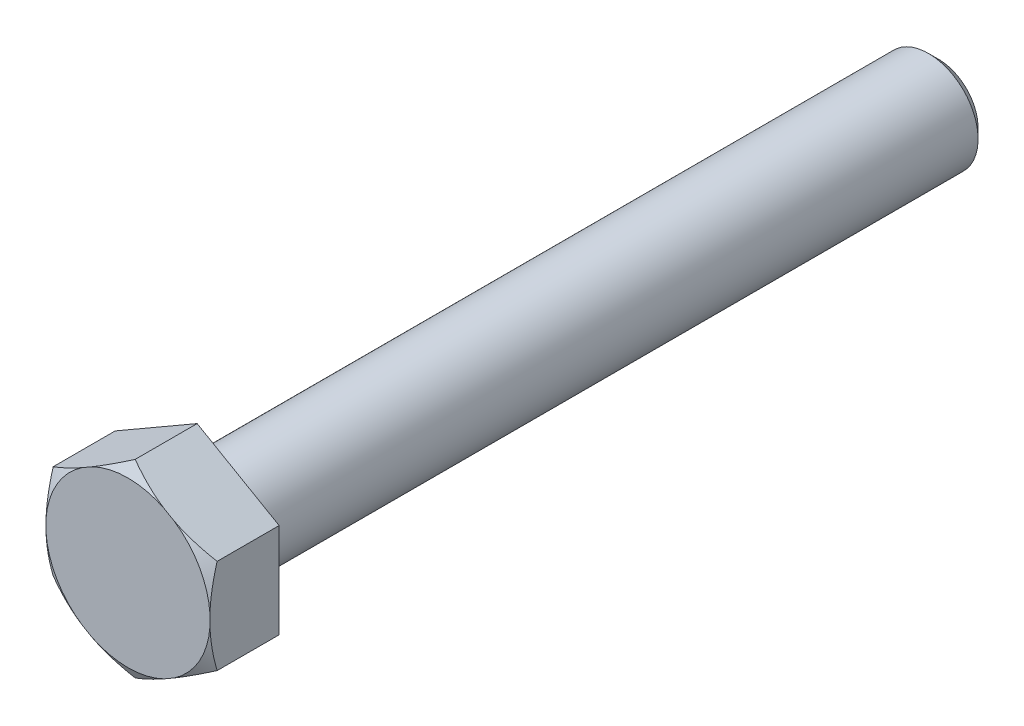
ISO-10303-21;
HEADER;
FILE_DESCRIPTION(('STEP AP214'),'2;1');
FILE_NAME('part.step','',(''),(''),'','','');
FILE_SCHEMA(('AUTOMOTIVE_DESIGN { 1 0 10303 214 1 1 1 1 }'));
ENDSEC;
DATA;
#1=APPLICATION_CONTEXT('core data for automotive mechanical design processes');
#2=APPLICATION_PROTOCOL_DEFINITION('international standard','automotive_design',2000,#1);
#3=PRODUCT_CONTEXT('',#1,'mechanical');
#4=PRODUCT('Part','Part','',(#3));
#5=PRODUCT_RELATED_PRODUCT_CATEGORY('part','',(#4));
#6=PRODUCT_DEFINITION_FORMATION('','',#4);
#7=PRODUCT_DEFINITION_CONTEXT('part definition',#1,'design');
#8=PRODUCT_DEFINITION('design','',#6,#7);
#9=PRODUCT_DEFINITION_SHAPE('','',#8);
#10=(LENGTH_UNIT() NAMED_UNIT(*) SI_UNIT(.MILLI.,.METRE.));
#11=(NAMED_UNIT(*) PLANE_ANGLE_UNIT() SI_UNIT($,.RADIAN.));
#12=(NAMED_UNIT(*) SI_UNIT($,.STERADIAN.) SOLID_ANGLE_UNIT());
#13=UNCERTAINTY_MEASURE_WITH_UNIT(LENGTH_MEASURE(1.E-05),#10,'distance_accuracy_value','');
#14=(GEOMETRIC_REPRESENTATION_CONTEXT(3) GLOBAL_UNCERTAINTY_ASSIGNED_CONTEXT((#13)) GLOBAL_UNIT_ASSIGNED_CONTEXT((#10,
#11,#12)) REPRESENTATION_CONTEXT('',''));
#15=CARTESIAN_POINT('',(0.,0.,0.));
#16=DIRECTION('',(0.,0.,1.));
#17=DIRECTION('',(1.,0.,0.));
#18=AXIS2_PLACEMENT_3D('',#15,#16,#17);
#19=CARTESIAN_POINT('',(0.,0.,0.));
#20=DIRECTION('',(0.,0.,1.));
#21=DIRECTION('',(0.999999999999997,0.,0.));
#22=AXIS2_PLACEMENT_3D('',#19,#20,#21);
#23=PLANE('',#22);
#24=CARTESIAN_POINT('',(0.,0.,0.));
#25=DIRECTION('',(0.,0.,1.));
#26=DIRECTION('',(0.999999999999997,0.,0.));
#27=AXIS2_PLACEMENT_3D('',#24,#25,#26);
#28=CIRCLE('',#27,3.325);
#29=CARTESIAN_POINT('',(3.31687729649241,-0.232271392987038,0.));
#30=VERTEX_POINT('',#29);
#31=CARTESIAN_POINT('',(1.85959157514512,-2.75636430350722,-3.7470027081099E-13));
#32=VERTEX_POINT('',#31);
#33=EDGE_CURVE('E171',#30,#32,#28,.F.);
#34=ORIENTED_EDGE('',*,*,#33,.F.);
#35=DIRECTION('',(0.,0.999999999999989,0.));
#36=VECTOR('',#35,1.);
#37=CARTESIAN_POINT('',(3.31687729649335,-1.91500000000049,-3.92047505570758E-13));
#38=LINE('',#37,#36);
#39=CARTESIAN_POINT('',(3.31687729649247,0.232271392986212,0.));
#40=VERTEX_POINT('',#39);
#41=EDGE_CURVE('E297',#30,#40,#38,.T.);
#42=ORIENTED_EDGE('',*,*,#41,.T.);
#43=CARTESIAN_POINT('',(1.85959157514506,2.75636430350629,0.));
#44=VERTEX_POINT('',#43);
#45=EDGE_CURVE('E167',#44,#40,#28,.F.);
#46=ORIENTED_EDGE('',*,*,#45,.F.);
#47=DIRECTION('',(-0.86602540378443,0.499999999999995,0.));
#48=VECTOR('',#47,1.);
#49=CARTESIAN_POINT('',(3.31687729649346,1.91499999999944,0.));
#50=LINE('',#49,#48);
#51=CARTESIAN_POINT('',(1.45728572134776,2.98863569649339,0.));
#52=VERTEX_POINT('',#51);
#53=EDGE_CURVE('E306',#44,#52,#50,.T.);
#54=ORIENTED_EDGE('',*,*,#53,.T.);
#55=CARTESIAN_POINT('',(-1.45728572134907,2.9886356964936,0.));
#56=VERTEX_POINT('',#55);
#57=EDGE_CURVE('E169',#56,#52,#28,.F.);
#58=ORIENTED_EDGE('',*,*,#57,.F.);
#59=DIRECTION('',(-0.866025403784429,-0.499999999999997,0.));
#60=VECTOR('',#59,1.);
#61=CARTESIAN_POINT('',(-5.27355936696949E-13,3.83000000000001,0.));
#62=LINE('',#61,#60);
#63=CARTESIAN_POINT('',(-1.85959157514795,2.75636430350642,0.));
#64=VERTEX_POINT('',#63);
#65=EDGE_CURVE('E166',#56,#64,#62,.T.);
#66=ORIENTED_EDGE('',*,*,#65,.T.);
#67=CARTESIAN_POINT('',(0.,0.,0.));
#68=DIRECTION('',(0.,0.,-1.));
#69=DIRECTION('',(-0.999999999999997,0.,0.));
#70=AXIS2_PLACEMENT_3D('',#67,#68,#69);
#71=CIRCLE('',#70,3.325);
#72=CARTESIAN_POINT('',(-3.31687729649488,0.232271392986365,0.));
#73=VERTEX_POINT('',#72);
#74=EDGE_CURVE('E130',#73,#64,#71,.T.);
#75=ORIENTED_EDGE('',*,*,#74,.F.);
#76=DIRECTION('',(0.,-0.999999999999992,0.));
#77=VECTOR('',#76,1.);
#78=CARTESIAN_POINT('',(-3.31687729649571,1.91499999999966,0.));
#79=LINE('',#78,#77);
#80=CARTESIAN_POINT('',(-3.3168772964958,-0.23227139298726,0.));
#81=VERTEX_POINT('',#80);
#82=EDGE_CURVE('E145',#73,#81,#79,.T.);
#83=ORIENTED_EDGE('',*,*,#82,.T.);
#84=CARTESIAN_POINT('',(-1.85959157514634,-2.75636430350706,0.));
#85=VERTEX_POINT('',#84);
#86=EDGE_CURVE('E331',#85,#81,#28,.F.);
#87=ORIENTED_EDGE('',*,*,#86,.F.);
#88=DIRECTION('',(0.866025403784431,-0.499999999999995,0.));
#89=VECTOR('',#88,1.);
#90=CARTESIAN_POINT('',(-3.31687729649535,-1.91500000000028,0.));
#91=LINE('',#90,#89);
#92=CARTESIAN_POINT('',(-1.45728572134976,-2.98863569649399,0.));
#93=VERTEX_POINT('',#92);
#94=EDGE_CURVE('E154',#85,#93,#91,.T.);
#95=ORIENTED_EDGE('',*,*,#94,.T.);
#96=CARTESIAN_POINT('',(1.4572857213471,-2.98863569649376,-3.7470027081099E-13));
#97=VERTEX_POINT('',#96);
#98=EDGE_CURVE('E300',#97,#93,#28,.F.);
#99=ORIENTED_EDGE('',*,*,#98,.F.);
#100=DIRECTION('',(0.866025403784433,0.499999999999997,0.));
#101=VECTOR('',#100,1.);
#102=CARTESIAN_POINT('',(-9.99200722162641E-13,-3.83000000000062,-3.7470027081099E-13));
#103=LINE('',#102,#101);
#104=EDGE_CURVE('E299',#97,#32,#103,.T.);
#105=ORIENTED_EDGE('',*,*,#104,.T.);
#106=EDGE_LOOP('',(#34,#42,#46,#54,#58,#66,#75,#83,#87,#95,#99,#105));
#107=FACE_BOUND('',#106,.T.);
#108=ADVANCED_FACE('F37',(#107),#23,.T.);
#109=CARTESIAN_POINT('',(-4.00000000000031,-3.7470027081099E-13,-2.79999999999994));
#110=DIRECTION('',(0.,0.,-1.));
#111=DIRECTION('',(-0.999999999999997,0.,0.));
#112=AXIS2_PLACEMENT_3D('',#109,#110,#111);
#113=PLANE('',#112);
#114=CARTESIAN_POINT('',(0.,0.,-2.8));
#115=DIRECTION('',(0.,0.,-1.));
#116=DIRECTION('',(-0.999999999999997,0.,0.));
#117=AXIS2_PLACEMENT_3D('',#114,#115,#116);
#118=CIRCLE('',#117,2.4);
#119=CARTESIAN_POINT('',(-2.39999999999999,0.,-2.8));
#120=VERTEX_POINT('',#119);
#121=EDGE_CURVE('E12',#120,#120,#118,.F.);
#122=ORIENTED_EDGE('',*,*,#121,.T.);
#123=EDGE_LOOP('',(#122));
#124=FACE_BOUND('',#123,.T.);
#125=DIRECTION('',(-0.866025403784433,-0.499999999999997,0.));
#126=VECTOR('',#125,1.);
#127=CARTESIAN_POINT('',(-5.82867087928207E-13,3.82999999999994,-2.8));
#128=LINE('',#127,#126);
#129=CARTESIAN_POINT('',(-5.82867087928207E-13,3.82999999999994,-2.8));
#130=VERTEX_POINT('',#129);
#131=CARTESIAN_POINT('',(-3.31687729649546,1.91499999999972,-2.79999999999994));
#132=VERTEX_POINT('',#131);
#133=EDGE_CURVE('E152',#130,#132,#128,.T.);
#134=ORIENTED_EDGE('',*,*,#133,.F.);
#135=DIRECTION('',(-0.866025403784433,0.499999999999995,0.));
#136=VECTOR('',#135,1.);
#137=CARTESIAN_POINT('',(3.31687729649371,1.91499999999945,-2.80000000000002));
#138=LINE('',#137,#136);
#139=CARTESIAN_POINT('',(3.31687729649371,1.91499999999945,-2.80000000000002));
#140=VERTEX_POINT('',#139);
#141=EDGE_CURVE('E315',#140,#130,#138,.T.);
#142=ORIENTED_EDGE('',*,*,#141,.F.);
#143=DIRECTION('',(0.,0.999999999999989,0.));
#144=VECTOR('',#143,1.);
#145=CARTESIAN_POINT('',(3.31687729649335,-1.91500000000049,-2.80000000000039));
#146=LINE('',#145,#144);
#147=CARTESIAN_POINT('',(3.31687729649335,-1.91500000000049,-2.80000000000039));
#148=VERTEX_POINT('',#147);
#149=EDGE_CURVE('E311',#148,#140,#146,.T.);
#150=ORIENTED_EDGE('',*,*,#149,.F.);
#151=DIRECTION('',(0.866025403784433,0.499999999999997,0.));
#152=VECTOR('',#151,1.);
#153=CARTESIAN_POINT('',(-9.71445146547012E-13,-3.83000000000079,-2.80000000000038));
#154=LINE('',#153,#152);
#155=CARTESIAN_POINT('',(-9.71445146547012E-13,-3.83000000000079,-2.80000000000038));
#156=VERTEX_POINT('',#155);
#157=EDGE_CURVE('E170',#156,#148,#154,.T.);
#158=ORIENTED_EDGE('',*,*,#157,.F.);
#159=DIRECTION('',(0.866025403784433,-0.499999999999995,0.));
#160=VECTOR('',#159,1.);
#161=CARTESIAN_POINT('',(-3.31687729649535,-1.91500000000024,-2.79999999999994));
#162=LINE('',#161,#160);
#163=CARTESIAN_POINT('',(-3.31687729649535,-1.91500000000024,-2.79999999999994));
#164=VERTEX_POINT('',#163);
#165=EDGE_CURVE('E321',#164,#156,#162,.T.);
#166=ORIENTED_EDGE('',*,*,#165,.F.);
#167=DIRECTION('',(0.,-0.999999999999992,0.));
#168=VECTOR('',#167,1.);
#169=CARTESIAN_POINT('',(-3.31687729649546,1.91499999999972,-2.79999999999994));
#170=LINE('',#169,#168);
#171=EDGE_CURVE('E324',#132,#164,#170,.T.);
#172=ORIENTED_EDGE('',*,*,#171,.F.);
#173=EDGE_LOOP('',(#134,#142,#150,#158,#166,#172));
#174=FACE_BOUND('',#173,.T.);
#175=ADVANCED_FACE('F193',(#124,#174),#113,.T.);
#176=CARTESIAN_POINT('',(0.,0.,-32.8));
#177=DIRECTION('',(0.,0.,-1.));
#178=DIRECTION('',(-0.999999999999997,0.,0.));
#179=AXIS2_PLACEMENT_3D('',#176,#177,#178);
#180=CYLINDRICAL_SURFACE('',#179,2.);
#181=CARTESIAN_POINT('',(0.,0.,-3.2));
#182=DIRECTION('',(0.,0.,-1.));
#183=DIRECTION('',(-0.999999999999997,0.,0.));
#184=AXIS2_PLACEMENT_3D('',#181,#182,#183);
#185=CIRCLE('',#184,2.);
#186=CARTESIAN_POINT('',(-1.99999999999999,0.,-3.2));
#187=VERTEX_POINT('',#186);
#188=EDGE_CURVE('E45',#187,#187,#185,.T.);
#189=ORIENTED_EDGE('',*,*,#188,.T.);
#190=EDGE_LOOP('',(#189));
#191=FACE_BOUND('',#190,.T.);
#192=CARTESIAN_POINT('',(0.,0.,-32.4));
#193=DIRECTION('',(0.,0.,-1.));
#194=DIRECTION('',(-0.999999999999997,0.,0.));
#195=AXIS2_PLACEMENT_3D('',#192,#193,#194);
#196=CIRCLE('',#195,2.);
#197=CARTESIAN_POINT('',(-1.99999999999999,0.,-32.4));
#198=VERTEX_POINT('',#197);
#199=EDGE_CURVE('E175',#198,#198,#196,.F.);
#200=ORIENTED_EDGE('',*,*,#199,.T.);
#201=EDGE_LOOP('',(#200));
#202=FACE_BOUND('',#201,.T.);
#203=ADVANCED_FACE('F180',(#191,#202),#180,.T.);
#204=CARTESIAN_POINT('',(-2.00000000000009,-2.77555756156289E-13,-32.8));
#205=DIRECTION('',(0.,0.,-1.));
#206=DIRECTION('',(-0.999999999999997,0.,0.));
#207=AXIS2_PLACEMENT_3D('',#204,#205,#206);
#208=PLANE('',#207);
#209=CARTESIAN_POINT('',(0.,0.,-32.8));
#210=DIRECTION('',(0.,0.,-1.));
#211=DIRECTION('',(-0.999999999999997,0.,0.));
#212=AXIS2_PLACEMENT_3D('',#209,#210,#211);
#213=CIRCLE('',#212,1.6);
#214=CARTESIAN_POINT('',(-1.6,0.,-32.8));
#215=VERTEX_POINT('',#214);
#216=EDGE_CURVE('E172',#215,#215,#213,.T.);
#217=ORIENTED_EDGE('',*,*,#216,.T.);
#218=EDGE_LOOP('',(#217));
#219=FACE_BOUND('',#218,.T.);
#220=ADVANCED_FACE('F205',(#219),#208,.T.);
#221=CARTESIAN_POINT('',(3.31687729649305,1.91499999999933,-14.2551298552224));
#222=DIRECTION('',(0.499999999999995,0.866025403784433,0.));
#223=DIRECTION('',(-0.866025403784433,0.499999999999995,0.));
#224=AXIS2_PLACEMENT_3D('',#221,#222,#223);
#225=PLANE('',#224);
#226=CARTESIAN_POINT('',(5.62172629362934,0.584294811061696,-1.34349933439033));
#227=CARTESIAN_POINT('',(5.51750239060521,0.644468509528387,-1.28725167207965));
#228=CARTESIAN_POINT('',(5.41302925325586,0.704786103500005,-1.23161032715687));
#229=CARTESIAN_POINT('',(5.20347942037141,0.825769755924399,-1.12182497272012));
#230=CARTESIAN_POINT('',(5.09840265091746,0.886435857054246,-1.06768115152114));
#231=CARTESIAN_POINT('',(4.88722864154331,1.00835722821228,-0.961019118309528));
#232=CARTESIAN_POINT('',(4.78112921034615,1.06961376337482,-0.908506672656632));
#233=CARTESIAN_POINT('',(4.56813590600203,1.19258550497348,-0.805680571313064));
#234=CARTESIAN_POINT('',(4.4612420581774,1.25430069678975,-0.755366845886125));
#235=CARTESIAN_POINT('',(4.24379841199031,1.37984184444943,-0.656172231355927));
#236=CARTESIAN_POINT('',(4.13322484720057,1.44368152184603,-0.607360490359746));
#237=CARTESIAN_POINT('',(3.91096100065158,1.57200561348225,-0.513209643080796));
#238=CARTESIAN_POINT('',(3.79927065089341,1.63649006698106,-0.467870749726781));
#239=CARTESIAN_POINT('',(3.57475351404663,1.76611509637711,-0.381529270759792));
#240=CARTESIAN_POINT('',(3.46192797603648,1.83125495111857,-0.340522391209661));
#241=CARTESIAN_POINT('',(3.23494131189358,1.96230576276437,-0.263789020052386));
#242=CARTESIAN_POINT('',(3.12078029875724,2.0282166544302,-0.228062085139542));
#243=CARTESIAN_POINT('',(2.84781898860283,2.18581094032646,-0.150779586359264));
#244=CARTESIAN_POINT('',(2.688392760782,2.2778557158739,-0.112092988464069));
#245=CARTESIAN_POINT('',(2.36727550688825,2.46325284885032,-0.0501062405225344));
#246=CARTESIAN_POINT('',(2.20558529212126,2.55660473787161,-0.026800715796183));
#247=CARTESIAN_POINT('',(1.96313191693367,2.69658525930216,-0.00531895884453521));
#248=CARTESIAN_POINT('',(1.88279263235706,2.74296916687895,-0.000394837494358045));
#249=CARTESIAN_POINT('',(1.7219970208436,2.83580455647076,0.00496753970631893));
#250=CARTESIAN_POINT('',(1.64154069515193,2.88225603776689,0.00540584293618167));
#251=CARTESIAN_POINT('',(1.4807029774347,2.97511573738669,0.00177609392531248));
#252=CARTESIAN_POINT('',(1.4003215881376,3.0215239541351,-0.00229211644181273));
#253=CARTESIAN_POINT('',(1.23981324881529,3.11419348705032,-0.0148097388609985));
#254=CARTESIAN_POINT('',(1.15968631688689,3.16045479276895,-0.0232594557994741));
#255=CARTESIAN_POINT('',(0.970482918174319,3.26969142594742,-0.0481712002888731));
#256=CARTESIAN_POINT('',(0.861583155004696,3.33256473352754,-0.0664362042312166));
#257=CARTESIAN_POINT('',(0.644823571130728,3.45771093762619,-0.10986646969134));
#258=CARTESIAN_POINT('',(0.536963904069949,3.51998374543859,-0.13503273498043));
#259=CARTESIAN_POINT('',(0.322298711808424,3.64392075197653,-0.191315596723425));
#260=CARTESIAN_POINT('',(0.21549452132841,3.70558418010071,-0.222438911308223));
#261=CARTESIAN_POINT('',(0.00308429644280108,3.82821928061701,-0.289655544512036));
#262=CARTESIAN_POINT('',(-0.102521813307327,3.88919099650931,-0.325748548702331));
#263=CARTESIAN_POINT('',(-0.313862935943265,4.01120885055404,-0.402500734841433));
#264=CARTESIAN_POINT('',(-0.419584395764037,4.07224716384072,-0.443209347984687));
#265=CARTESIAN_POINT('',(-0.629904407733042,4.19367547936689,-0.528055943094057));
#266=CARTESIAN_POINT('',(-0.734503652779964,4.25406588165163,-0.572191651621626));
#267=CARTESIAN_POINT('',(-1.04686737770765,4.43440916232425,-0.708796466798412));
#268=CARTESIAN_POINT('',(-1.25325045598314,4.55356448812442,-0.805483077200789));
#269=CARTESIAN_POINT('',(-1.52973841937145,4.71319488821318,-0.941034706860723));
#270=CARTESIAN_POINT('',(-1.60110125208636,4.75439623889066,-0.976568885707692));
#271=CARTESIAN_POINT('',(-1.74351306044228,4.83661773478029,-1.0484640977587));
#272=CARTESIAN_POINT('',(-1.81456204648438,4.87763788599752,-1.08482510331187));
#273=CARTESIAN_POINT('',(-1.95562500708723,4.95908062427436,-1.15788245032697));
#274=CARTESIAN_POINT('',(-2.02564196432375,4.99950493338263,-1.19457113908888));
#275=CARTESIAN_POINT('',(-2.16542641207332,5.08020952191941,-1.26858074581905));
#276=CARTESIAN_POINT('',(-2.23519389819317,5.1204897988115,-1.30590167485537));
#277=CARTESIAN_POINT('',(-2.30484899713743,5.16070518893781,-1.34349933439024));
#278=B_SPLINE_CURVE_WITH_KNOTS('',3,(#226,#227,#228,#229,#230,#231,#232,#233,#234,#235,#236,
#237,#238,#239,#240,#241,#242,#243,#244,#245,#246,#247,#248,#249,#250,#251,#252,#253,#254,#255,
#256,#257,#258,#259,#260,#261,#262,#263,#264,#265,#266,#267,#268,#269,#270,#271,#272,#273,#274,
#275,#276,#277),.UNSPECIFIED.,.F.,.F.,(4,2,2,2,2,2,2,2,2,2,2,2,2,2,2,2,2,2,2,2,2,2,2,2,2,4),(0.,
0.398533636659786,0.797117163512709,1.19697817392836,1.59682649283269,2.00686036937064,
2.41691936599495,2.82656801692986,3.23618225407996,3.79999820011022,4.36361702484843,
4.64221895453388,4.92081794161328,5.19942670459761,5.47805485712907,5.85902313260728,
6.24004684839067,6.62150282726768,7.00293468277698,7.3889266616527,7.77466473665769,
8.54594940820077,8.81516386294546,9.08436932777949,9.3507181453749,9.61707163053212),.UNSPECIFIED.);
#279=CARTESIAN_POINT('',(3.31687729649346,1.91499999999944,-0.291561885940778));
#280=VERTEX_POINT('',#279);
#281=EDGE_CURVE('E224',#280,#44,#278,.T.);
#282=ORIENTED_EDGE('',*,*,#281,.F.);
#283=DIRECTION('',(0.,0.,1.));
#284=VECTOR('',#283,1.);
#285=CARTESIAN_POINT('',(3.31687729649305,1.91499999999933,-14.2551298552224));
#286=LINE('',#285,#284);
#287=EDGE_CURVE('E314',#140,#280,#286,.T.);
#288=ORIENTED_EDGE('',*,*,#287,.F.);
#289=ORIENTED_EDGE('',*,*,#141,.T.);
#290=DIRECTION('',(0.,0.,1.));
#291=VECTOR('',#290,1.);
#292=CARTESIAN_POINT('',(-9.71445146547012E-13,3.82999999999983,-14.2551298552224));
#293=LINE('',#292,#291);
#294=CARTESIAN_POINT('',(-5.27355936696949E-13,3.83000000000001,-0.291561885940761));
#295=VERTEX_POINT('',#294);
#296=EDGE_CURVE('E156',#130,#295,#293,.T.);
#297=ORIENTED_EDGE('',*,*,#296,.T.);
#298=EDGE_CURVE('E218',#52,#295,#278,.T.);
#299=ORIENTED_EDGE('',*,*,#298,.F.);
#300=ORIENTED_EDGE('',*,*,#53,.F.);
#301=EDGE_LOOP('',(#282,#288,#289,#297,#299,#300));
#302=FACE_BOUND('',#301,.T.);
#303=ADVANCED_FACE('F208',(#302),#225,.T.);
#304=CARTESIAN_POINT('',(3.31687729649352,-1.91500000000038,-14.2551298552224));
#305=DIRECTION('',(0.999999999999989,0.,0.));
#306=DIRECTION('',(0.,0.999999999999989,0.));
#307=AXIS2_PLACEMENT_3D('',#304,#305,#306);
#308=PLANE('',#307);
#309=CARTESIAN_POINT('',(3.31687729649388,-4.21984899713607,-1.17917039043266));
#310=CARTESIAN_POINT('',(3.31687729649365,-4.10000949336655,-1.12478805347089));
#311=CARTESIAN_POINT('',(3.31687729649356,-3.97984254129548,-1.07111397821055));
#312=CARTESIAN_POINT('',(3.31687729649349,-3.73871307819003,-0.965525815544475));
#313=CARTESIAN_POINT('',(3.31687729649351,-3.61775042780843,-0.913612046770251));
#314=CARTESIAN_POINT('',(3.31687729649353,-3.37442550283509,-0.811695663946448));
#315=CARTESIAN_POINT('',(3.31687729649352,-3.25205949458831,-0.761701925913546));
#316=CARTESIAN_POINT('',(3.31687729649352,-3.0062948611852,-0.664331057871746));
#317=CARTESIAN_POINT('',(3.31687729649352,-2.88289628379633,-0.616953807584253));
#318=CARTESIAN_POINT('',(3.31687729649352,-2.63546003382932,-0.525599468441611));
#319=CARTESIAN_POINT('',(3.31687729649351,-2.5114276585148,-0.481608170452099));
#320=CARTESIAN_POINT('',(3.31687729649353,-2.26205366968913,-0.397515974193437));
#321=CARTESIAN_POINT('',(3.31687729649354,-2.13671197321933,-0.357415324112444));
#322=CARTESIAN_POINT('',(3.31687729649347,-1.75885360678068,-0.244320609772059));
#323=CARTESIAN_POINT('',(3.31687729649326,-1.50409759296114,-0.178378158069418));
#324=CARTESIAN_POINT('',(3.31687729649332,-1.06189130491966,-0.0885886296743932));
#325=CARTESIAN_POINT('',(3.31687729649347,-0.875808171654898,-0.0581091142757047));
#326=CARTESIAN_POINT('',(3.31687729649357,-0.501622663468749,-0.0142041380376897));
#327=CARTESIAN_POINT('',(3.31687729649351,-0.313520984802516,-0.000772976043901139));
#328=CARTESIAN_POINT('',(3.31687729649353,0.0630047324708242,0.00742224037655519));
#329=CARTESIAN_POINT('',(3.3168772964936,0.251428543902196,0.00219630896804801));
#330=CARTESIAN_POINT('',(3.31687729649343,0.626879705184367,-0.0262406018735553));
#331=CARTESIAN_POINT('',(3.31687729649318,0.813906816708676,-0.0494545829690302));
#332=CARTESIAN_POINT('',(3.31687729649306,1.27844227697668,-0.126826721919414));
#333=CARTESIAN_POINT('',(3.31687729649343,1.55431995910555,-0.190662587732962));
#334=CARTESIAN_POINT('',(3.31687729649356,1.96309568301121,-0.304502553024612));
#335=CARTESIAN_POINT('',(3.31687729649353,2.09869210615851,-0.345530608545601));
#336=CARTESIAN_POINT('',(3.3168772964935,2.36831431944282,-0.432479205035638));
#337=CARTESIAN_POINT('',(3.31687729649351,2.50234021918129,-0.478399402314485));
#338=CARTESIAN_POINT('',(3.31687729649352,2.77049868768246,-0.574716532222979));
#339=CARTESIAN_POINT('',(3.31687729649352,2.90461473734085,-0.625158898344773));
#340=CARTESIAN_POINT('',(3.31687729649351,3.1715935869106,-0.729272474235971));
#341=CARTESIAN_POINT('',(3.3168772964935,3.30445630725258,-0.782943887431247));
#342=CARTESIAN_POINT('',(3.31687729649353,3.56827338615256,-0.892538965805893));
#343=CARTESIAN_POINT('',(3.31687729649358,3.69923447779733,-0.948446507283879));
#344=CARTESIAN_POINT('',(3.31687729649345,3.96020721757609,-1.06235217791999));
#345=CARTESIAN_POINT('',(3.31687729649327,4.09021909227352,-1.12034978719465));
#346=CARTESIAN_POINT('',(3.31687729649283,4.21984899713558,-1.17917039043228));
#347=B_SPLINE_CURVE_WITH_KNOTS('',3,(#309,#310,#311,#312,#313,#314,#315,#316,#317,#318,#319,
#320,#321,#322,#323,#324,#325,#326,#327,#328,#329,#330,#331,#332,#333,#334,#335,#336,#337,#338,
#339,#340,#341,#342,#343,#344,#345,#346),.UNSPECIFIED.,.F.,.F.,(4,2,2,2,2,2,2,2,2,2,2,2,2,2,2,2,
2,2,4),(0.,0.394810216599165,0.789691520042465,1.18622011495053,1.58273046644465,
1.97747413628929,2.37224297067723,3.16047837207734,3.72552520413089,4.29038302856405,
4.85493771206349,5.41958662298677,6.26722815435193,6.69218728492859,7.11711658029141,
7.54693554202079,7.97678161021181,8.40394840888892,8.83100967771648),.UNSPECIFIED.);
#348=CARTESIAN_POINT('',(3.31687729649335,-1.91500000000049,-0.291561885941153));
#349=VERTEX_POINT('',#348);
#350=EDGE_CURVE('E256',#349,#30,#347,.T.);
#351=ORIENTED_EDGE('',*,*,#350,.F.);
#352=DIRECTION('',(0.,0.,1.));
#353=VECTOR('',#352,1.);
#354=CARTESIAN_POINT('',(3.31687729649352,-1.91500000000038,-14.2551298552224));
#355=LINE('',#354,#353);
#356=EDGE_CURVE('E304',#148,#349,#355,.T.);
#357=ORIENTED_EDGE('',*,*,#356,.F.);
#358=ORIENTED_EDGE('',*,*,#149,.T.);
#359=ORIENTED_EDGE('',*,*,#287,.T.);
#360=EDGE_CURVE('E293',#40,#280,#347,.T.);
#361=ORIENTED_EDGE('',*,*,#360,.F.);
#362=ORIENTED_EDGE('',*,*,#41,.F.);
#363=EDGE_LOOP('',(#351,#357,#358,#359,#361,#362));
#364=FACE_BOUND('',#363,.T.);
#365=ADVANCED_FACE('F213',(#364),#308,.T.);
#366=CARTESIAN_POINT('',(-1.19348975147204E-12,-3.83000000000079,-14.2551298552224));
#367=DIRECTION('',(0.499999999999997,-0.866025403784433,0.));
#368=DIRECTION('',(0.866025403784433,0.499999999999997,0.));
#369=AXIS2_PLACEMENT_3D('',#366,#367,#368);
#370=PLANE('',#369);
#371=CARTESIAN_POINT('',(-2.30484899713687,-5.16070518893841,-1.34349933439063));
#372=CARTESIAN_POINT('',(-2.20062509411263,-5.10053149047144,-1.28725167208046));
#373=CARTESIAN_POINT('',(-2.09615195676322,-5.0402138964997,-1.23161032715789));
#374=CARTESIAN_POINT('',(-1.88660212387872,-4.91923024407521,-1.12182497272128));
#375=CARTESIAN_POINT('',(-1.78152535442476,-4.85856414294539,-1.06768115152224));
#376=CARTESIAN_POINT('',(-1.57035134505059,-4.73664277178735,-0.961019118310567));
#377=CARTESIAN_POINT('',(-1.4642519138534,-4.67538623662479,-0.908506672657673));
#378=CARTESIAN_POINT('',(-1.25125860950923,-4.55241449502609,-0.805680571314093));
#379=CARTESIAN_POINT('',(-1.14436476168457,-4.49069930320981,-0.755366845887138));
#380=CARTESIAN_POINT('',(-0.926921115497439,-4.3651581555501,-0.656172231356926));
#381=CARTESIAN_POINT('',(-0.816347550707685,-4.30131847815348,-0.607360490360748));
#382=CARTESIAN_POINT('',(-0.594083704158646,-4.17299438651726,-0.513209643081764));
#383=CARTESIAN_POINT('',(-0.482393354400443,-4.10850993301847,-0.467870749727712));
#384=CARTESIAN_POINT('',(-0.257876217553662,-3.97888490362232,-0.381529270760784));
#385=CARTESIAN_POINT('',(-0.145050679543536,-3.91374504888074,-0.340522391210749));
#386=CARTESIAN_POINT('',(0.0819359845994729,-3.78269423723524,-0.263789020053192));
#387=CARTESIAN_POINT('',(0.19609699773595,-3.71678334556984,-0.22806208513997));
#388=CARTESIAN_POINT('',(0.469058307890353,-3.5591890596738,-0.150779586359541));
#389=CARTESIAN_POINT('',(0.628484535710933,-3.46714428412583,-0.112092988464843));
#390=CARTESIAN_POINT('',(0.949601789604446,-3.28174715114907,-0.0501062405236362));
#391=CARTESIAN_POINT('',(1.11129200437145,-3.18839526212797,-0.0268007157971172));
#392=CARTESIAN_POINT('',(1.35374537955899,-3.04841474069751,-0.00531895884537826));
#393=CARTESIAN_POINT('',(1.43408466413558,-3.00203083312072,-0.000394837495196979));
#394=CARTESIAN_POINT('',(1.594880275649,-2.90919544352892,0.00496753970551973));
#395=CARTESIAN_POINT('',(1.67533660134066,-2.86274396223281,0.00540584293541789));
#396=CARTESIAN_POINT('',(1.83617431905783,-2.76988426261302,0.00177609392457321));
#397=CARTESIAN_POINT('',(1.9165557083549,-2.72347604586462,-0.00229211644256258));
#398=CARTESIAN_POINT('',(2.07706404767719,-2.63080651294945,-0.0148097388615937));
#399=CARTESIAN_POINT('',(2.15719097960562,-2.58454520723089,-0.023259455799904));
#400=CARTESIAN_POINT('',(2.3463943783182,-2.47530857405244,-0.0481712002891785));
#401=CARTESIAN_POINT('',(2.45529414148778,-2.41243526647226,-0.0664362042316619));
#402=CARTESIAN_POINT('',(2.67205372536174,-2.28728906237353,-0.109866469691847));
#403=CARTESIAN_POINT('',(2.77991339242255,-2.22501625456114,-0.135032734980859));
#404=CARTESIAN_POINT('',(2.99457858468414,-2.10107924802318,-0.191315596723765));
#405=CARTESIAN_POINT('',(3.10138277516419,-2.03941581989898,-0.222438911308553));
#406=CARTESIAN_POINT('',(3.31379300004985,-1.91678071938264,-0.289655544512331));
#407=CARTESIAN_POINT('',(3.4193991098,-1.85580900349031,-0.3257485487026));
#408=CARTESIAN_POINT('',(3.630740232436,-1.73379114944557,-0.402500734841673));
#409=CARTESIAN_POINT('',(3.73646169225681,-1.6727528361589,-0.443209347984923));
#410=CARTESIAN_POINT('',(3.94678170422583,-1.55132452063263,-0.528055943094239));
#411=CARTESIAN_POINT('',(4.05138094927274,-1.49093411834778,-0.572191651621759));
#412=CARTESIAN_POINT('',(4.36374467420065,-1.31059083767553,-0.708796466798661));
#413=CARTESIAN_POINT('',(4.57012775247667,-1.19143551187654,-0.805483077201468));
#414=CARTESIAN_POINT('',(4.84661571586465,-1.03180511178691,-0.941034706861044));
#415=CARTESIAN_POINT('',(4.91797854857934,-0.990603761108998,-0.976568885707817));
#416=CARTESIAN_POINT('',(5.06039035693505,-0.90838226521908,-1.04846409775866));
#417=CARTESIAN_POINT('',(5.13143934297714,-0.867362114001997,-1.08482510331185));
#418=CARTESIAN_POINT('',(5.27250230357997,-0.785919375725295,-1.15788245032689));
#419=CARTESIAN_POINT('',(5.34251926081646,-0.745495066617022,-1.19457113908871));
#420=CARTESIAN_POINT('',(5.48230370856588,-0.66479047808024,-1.26858074581894));
#421=CARTESIAN_POINT('',(5.55207119468558,-0.624510201188157,-1.30590167485541));
#422=CARTESIAN_POINT('',(5.62172629362959,-0.584294811061932,-1.34349933439071));
#423=B_SPLINE_CURVE_WITH_KNOTS('',3,(#371,#372,#373,#374,#375,#376,#377,#378,#379,#380,#381,
#382,#383,#384,#385,#386,#387,#388,#389,#390,#391,#392,#393,#394,#395,#396,#397,#398,#399,#400,
#401,#402,#403,#404,#405,#406,#407,#408,#409,#410,#411,#412,#413,#414,#415,#416,#417,#418,#419,
#420,#421,#422),.UNSPECIFIED.,.F.,.F.,(4,2,2,2,2,2,2,2,2,2,2,2,2,2,2,2,2,2,2,2,2,2,2,2,2,4),(0.,
0.398533636659817,0.797117163512783,1.19697817392854,1.59682649283296,2.00686036937098,
2.41691936599536,2.82656801693031,3.23618225408042,3.79999820011049,4.36361702484855,
4.64221895453394,4.92081794161328,5.19942670459752,5.4780548571289,5.85902313260715,
6.24004684839059,6.62150282726769,7.00293468277707,7.38892666165287,7.7746647366579,
8.54594940820112,8.81516386294564,9.08436932777951,9.35071814537476,9.61707163053183),.UNSPECIFIED.);
#424=CARTESIAN_POINT('',(-9.99200722162641E-13,-3.83000000000062,-0.291561885941136));
#425=VERTEX_POINT('',#424);
#426=EDGE_CURVE('E52',#425,#97,#423,.T.);
#427=ORIENTED_EDGE('',*,*,#426,.F.);
#428=DIRECTION('',(0.,0.,1.));
#429=VECTOR('',#428,1.);
#430=CARTESIAN_POINT('',(-1.19348975147204E-12,-3.83000000000079,-14.2551298552224));
#431=LINE('',#430,#429);
#432=EDGE_CURVE('E303',#156,#425,#431,.T.);
#433=ORIENTED_EDGE('',*,*,#432,.F.);
#434=ORIENTED_EDGE('',*,*,#157,.T.);
#435=ORIENTED_EDGE('',*,*,#356,.T.);
#436=EDGE_CURVE('E254',#32,#349,#423,.T.);
#437=ORIENTED_EDGE('',*,*,#436,.F.);
#438=ORIENTED_EDGE('',*,*,#104,.F.);
#439=EDGE_LOOP('',(#427,#433,#434,#435,#437,#438));
#440=FACE_BOUND('',#439,.T.);
#441=ADVANCED_FACE('F261',(#440),#370,.T.);
#442=CARTESIAN_POINT('',(-3.31687729649474,-1.91500000000002,-14.2551298552224));
#443=DIRECTION('',(-0.499999999999995,-0.866025403784433,0.));
#444=DIRECTION('',(0.866025403784433,-0.499999999999995,0.));
#445=AXIS2_PLACEMENT_3D('',#442,#443,#444);
#446=PLANE('',#445);
#447=CARTESIAN_POINT('',(-5.62172629363192,-0.584294811062529,-1.34349933439024));
#448=CARTESIAN_POINT('',(-5.5175023906073,-0.644468509529085,-1.28725167208032));
#449=CARTESIAN_POINT('',(-5.41302925325775,-0.70478610350065,-1.23161032715785));
#450=CARTESIAN_POINT('',(-5.20347942037313,-0.825769755925016,-1.12182497272131));
#451=CARTESIAN_POINT('',(-5.09840265091921,-0.886435857054887,-1.06768115152225));
#452=CARTESIAN_POINT('',(-4.88722864154505,-1.00835722821297,-0.961019118310549));
#453=CARTESIAN_POINT('',(-4.78112921034783,-1.06961376337553,-0.908506672657657));
#454=CARTESIAN_POINT('',(-4.56813590600362,-1.19258550497423,-0.805680571314071));
#455=CARTESIAN_POINT('',(-4.46124205817896,-1.25430069679052,-0.755366845887109));
#456=CARTESIAN_POINT('',(-4.24379841199179,-1.37984184445025,-0.656172231356886));
#457=CARTESIAN_POINT('',(-4.13322484720201,-1.44368152184688,-0.607360490360706));
#458=CARTESIAN_POINT('',(-3.91096100065293,-1.57200561348314,-0.513209643081696));
#459=CARTESIAN_POINT('',(-3.79927065089472,-1.63649006698197,-0.467870749727621));
#460=CARTESIAN_POINT('',(-3.57475351404784,-1.76611509637808,-0.381529270760733));
#461=CARTESIAN_POINT('',(-3.46192797603763,-1.83125495111958,-0.340522391210761));
#462=CARTESIAN_POINT('',(-3.23494131189478,-1.96230576276534,-0.263789020053033));
#463=CARTESIAN_POINT('',(-3.12078029875856,-2.02821665443109,-0.228062085139576));
#464=CARTESIAN_POINT('',(-2.84781898860427,-2.18581094032727,-0.150779586359068));
#465=CARTESIAN_POINT('',(-2.68839276078336,-2.27785571587478,-0.112092988464703));
#466=CARTESIAN_POINT('',(-2.36727550688961,-2.46325284885122,-0.050106240523744));
#467=CARTESIAN_POINT('',(-2.2055852921227,-2.55660473787246,-0.0268007157971418));
#468=CARTESIAN_POINT('',(-1.9631319169352,-2.69658525930295,-0.00531895884540149));
#469=CARTESIAN_POINT('',(-1.8827926323586,-2.74296916687972,-0.000394837495239848));
#470=CARTESIAN_POINT('',(-1.72199702084519,-2.83580455647152,0.0049675397054743));
#471=CARTESIAN_POINT('',(-1.64154069515355,-2.88225603776766,0.00540584293538934));
#472=CARTESIAN_POINT('',(-1.48070297743636,-2.97511573738738,0.00177609392447524));
#473=CARTESIAN_POINT('',(-1.40032158813927,-3.02152395413569,-0.0022921164427465));
#474=CARTESIAN_POINT('',(-1.2398132488171,-3.11419348705106,-0.014809738861567));
#475=CARTESIAN_POINT('',(-1.15968631688883,-3.16045479276992,-0.0232594557995803));
#476=CARTESIAN_POINT('',(-0.970482918176381,-3.26969142594845,-0.0481712002887303));
#477=CARTESIAN_POINT('',(-0.86158315500668,-3.33256473352821,-0.0664362042315981));
#478=CARTESIAN_POINT('',(-0.644823571132683,-3.45771093762659,-0.109866469692053));
#479=CARTESIAN_POINT('',(-0.536963904071952,-3.51998374543906,-0.13503273498095));
#480=CARTESIAN_POINT('',(-0.322298711810465,-3.64392075197706,-0.19131559672376));
#481=CARTESIAN_POINT('',(-0.215494521330441,-3.70558418010122,-0.222438911308567));
#482=CARTESIAN_POINT('',(-0.00308429644482389,-3.8282192806175,-0.28965554451234));
#483=CARTESIAN_POINT('',(0.102521813305303,-3.88919099650981,-0.325748548702585));
#484=CARTESIAN_POINT('',(0.313862935941226,-4.01120885055455,-0.402500734841629));
#485=CARTESIAN_POINT('',(0.419584395761984,-4.07224716384123,-0.443209347984873));
#486=CARTESIAN_POINT('',(0.62990440773102,-4.19367547936736,-0.528055943094142));
#487=CARTESIAN_POINT('',(0.734503652777987,-4.25406588165205,-0.572191651621618));
#488=CARTESIAN_POINT('',(1.04686737770542,-4.43440916232484,-0.708796466798569));
#489=CARTESIAN_POINT('',(1.25325045598024,-4.55356448812554,-0.805483077201647));
#490=CARTESIAN_POINT('',(1.52973841936901,-4.71319488821391,-0.941034706860976));
#491=CARTESIAN_POINT('',(1.60110125208416,-4.75439623889118,-0.976568885707645));
#492=CARTESIAN_POINT('',(1.74351306044023,-4.83661773478065,-1.04846409775842));
#493=CARTESIAN_POINT('',(1.81456204648224,-4.87763788599792,-1.08482510331166));
#494=CARTESIAN_POINT('',(1.95562500708502,-4.95908062427479,-1.15788245032673));
#495=CARTESIAN_POINT('',(2.02564196432156,-4.99950493338304,-1.19457113908856));
#496=CARTESIAN_POINT('',(2.16542641207106,-5.08020952191977,-1.26858074581881));
#497=CARTESIAN_POINT('',(2.23519389819081,-5.12048979881181,-1.30590167485531));
#498=CARTESIAN_POINT('',(2.30484899713479,-5.16070518893808,-1.34349933439069));
#499=B_SPLINE_CURVE_WITH_KNOTS('',3,(#447,#448,#449,#450,#451,#452,#453,#454,#455,#456,#457,
#458,#459,#460,#461,#462,#463,#464,#465,#466,#467,#468,#469,#470,#471,#472,#473,#474,#475,#476,
#477,#478,#479,#480,#481,#482,#483,#484,#485,#486,#487,#488,#489,#490,#491,#492,#493,#494,#495,
#496,#497,#498),.UNSPECIFIED.,.F.,.F.,(4,2,2,2,2,2,2,2,2,2,2,2,2,2,2,2,2,2,2,2,2,2,2,2,2,4),(0.,
0.398533636659814,0.797117163512788,1.1969781739286,1.59682649283306,2.00686036937116,
2.41691936599564,2.82656801693065,3.2361822540808,3.79999820011083,4.3636170248489,
4.64221895453426,4.92081794161359,5.19942670459781,5.47805485712913,5.8590231326072,
6.2400468483905,6.6215028272675,7.00293468277677,7.38892666165246,7.77466473665738,
8.54594940820037,8.81516386294499,9.08436932777895,9.35071814537428,9.61707163053143),.UNSPECIFIED.);
#500=CARTESIAN_POINT('',(-3.31687729649535,-1.91500000000028,-0.291561885940705));
#501=VERTEX_POINT('',#500);
#502=EDGE_CURVE('E60',#501,#85,#499,.T.);
#503=ORIENTED_EDGE('',*,*,#502,.F.);
#504=DIRECTION('',(0.,0.,1.));
#505=VECTOR('',#504,1.);
#506=CARTESIAN_POINT('',(-3.31687729649474,-1.91500000000002,-14.2551298552224));
#507=LINE('',#506,#505);
#508=EDGE_CURVE('E159',#164,#501,#507,.T.);
#509=ORIENTED_EDGE('',*,*,#508,.F.);
#510=ORIENTED_EDGE('',*,*,#165,.T.);
#511=ORIENTED_EDGE('',*,*,#432,.T.);
#512=EDGE_CURVE('E255',#93,#425,#499,.T.);
#513=ORIENTED_EDGE('',*,*,#512,.F.);
#514=ORIENTED_EDGE('',*,*,#94,.F.);
#515=EDGE_LOOP('',(#503,#509,#510,#511,#513,#514));
#516=FACE_BOUND('',#515,.T.);
#517=ADVANCED_FACE('F264',(#516),#446,.T.);
#518=CARTESIAN_POINT('',(-3.31687729649488,1.91499999999951,-14.2551298552224));
#519=DIRECTION('',(-0.999999999999992,0.,0.));
#520=DIRECTION('',(0.,-0.999999999999992,0.));
#521=AXIS2_PLACEMENT_3D('',#518,#519,#520);
#522=PLANE('',#521);
#523=CARTESIAN_POINT('',(-3.3168772964956,4.21984899713574,-1.17917039043221));
#524=CARTESIAN_POINT('',(-3.31687729649514,4.10000949336603,-1.12478805347087));
#525=CARTESIAN_POINT('',(-3.31687729649495,3.9798425412949,-1.07111397821072));
#526=CARTESIAN_POINT('',(-3.31687729649481,3.7387130781894,-0.965525815544797));
#527=CARTESIAN_POINT('',(-3.31687729649486,3.61775042780781,-0.91361204677054));
#528=CARTESIAN_POINT('',(-3.3168772964949,3.37442550283445,-0.811695663946713));
#529=CARTESIAN_POINT('',(-3.31687729649489,3.25205949458762,-0.761701925913821));
#530=CARTESIAN_POINT('',(-3.31687729649487,3.00629486118443,-0.664331057872036));
#531=CARTESIAN_POINT('',(-3.31687729649487,2.88289628379553,-0.616953807584549));
#532=CARTESIAN_POINT('',(-3.31687729649489,2.63546003382847,-0.525599468441908));
#533=CARTESIAN_POINT('',(-3.31687729649491,2.51142765851392,-0.481608170452389));
#534=CARTESIAN_POINT('',(-3.31687729649485,2.26205366968819,-0.397515974193811));
#535=CARTESIAN_POINT('',(-3.31687729649476,2.13671197321835,-0.357415324112908));
#536=CARTESIAN_POINT('',(-3.31687729649512,1.75885360677974,-0.244320609772277));
#537=CARTESIAN_POINT('',(-3.31687729649618,1.50409759296041,-0.178378158068762));
#538=CARTESIAN_POINT('',(-3.3168772964959,1.06189130491896,-0.0885886296741008));
#539=CARTESIAN_POINT('',(-3.31687729649516,0.875808171654121,-0.0581091142761212));
#540=CARTESIAN_POINT('',(-3.3168772964946,0.501622663467922,-0.0142041380386243));
#541=CARTESIAN_POINT('',(-3.31687729649479,0.313520984801717,-0.000772976044648574));
#542=CARTESIAN_POINT('',(-3.31687729649497,-0.0630047324715797,0.00742224037576483));
#543=CARTESIAN_POINT('',(-3.31687729649497,-0.251428543902935,0.00219630896702744));
#544=CARTESIAN_POINT('',(-3.31687729649479,-0.626879705185129,-0.0262406018742088));
#545=CARTESIAN_POINT('',(-3.31687729649461,-0.813906816709476,-0.0494545829690829));
#546=CARTESIAN_POINT('',(-3.31687729649453,-1.2784422769774,-0.126826721919154));
#547=CARTESIAN_POINT('',(-3.31687729649482,-1.55431995910605,-0.190662587733589));
#548=CARTESIAN_POINT('',(-3.31687729649491,-1.96309568301163,-0.30450255302552));
#549=CARTESIAN_POINT('',(-3.31687729649489,-2.09869210615896,-0.345530608546434));
#550=CARTESIAN_POINT('',(-3.31687729649487,-2.3683143194433,-0.43247920503641));
#551=CARTESIAN_POINT('',(-3.31687729649488,-2.50234021918177,-0.478399402315272));
#552=CARTESIAN_POINT('',(-3.31687729649488,-2.77049868768295,-0.574716532223775));
#553=CARTESIAN_POINT('',(-3.31687729649488,-2.90461473734135,-0.625158898345565));
#554=CARTESIAN_POINT('',(-3.31687729649488,-3.17159358691114,-0.729272474236747));
#555=CARTESIAN_POINT('',(-3.3168772964949,-3.30445630725314,-0.782943887432011));
#556=CARTESIAN_POINT('',(-3.31687729649487,-3.56827338615309,-0.89253896580668));
#557=CARTESIAN_POINT('',(-3.31687729649482,-3.69923447779782,-0.948446507284699));
#558=CARTESIAN_POINT('',(-3.31687729649494,-3.96020721757658,-1.06235217792062));
#559=CARTESIAN_POINT('',(-3.31687729649509,-4.09021909227406,-1.12034978719507));
#560=CARTESIAN_POINT('',(-3.31687729649546,-4.2198489971363,-1.17917039043221));
#561=B_SPLINE_CURVE_WITH_KNOTS('',3,(#523,#524,#525,#526,#527,#528,#529,#530,#531,#532,#533,
#534,#535,#536,#537,#538,#539,#540,#541,#542,#543,#544,#545,#546,#547,#548,#549,#550,#551,#552,
#553,#554,#555,#556,#557,#558,#559,#560),.UNSPECIFIED.,.F.,.F.,(4,2,2,2,2,2,2,2,2,2,2,2,2,2,2,2,
2,2,4),(0.,0.394810216599129,0.789691520042418,1.1862201149506,1.58273046644482,
1.97747413628949,2.37224297067751,3.16047837207757,3.72552520413099,4.29038302856414,
4.85493771206358,5.41958662298674,6.26722815435176,6.69218728492847,7.1171165802913,
7.5469355420207,7.97678161021177,8.40394840888879,8.83100967771622),.UNSPECIFIED.);
#562=CARTESIAN_POINT('',(-3.31687729649571,1.91499999999966,-0.291561885940705));
#563=VERTEX_POINT('',#562);
#564=EDGE_CURVE('E128',#563,#73,#561,.T.);
#565=ORIENTED_EDGE('',*,*,#564,.F.);
#566=DIRECTION('',(0.,0.,1.));
#567=VECTOR('',#566,1.);
#568=CARTESIAN_POINT('',(-3.31687729649488,1.91499999999951,-14.2551298552224));
#569=LINE('',#568,#567);
#570=EDGE_CURVE('E141',#132,#563,#569,.T.);
#571=ORIENTED_EDGE('',*,*,#570,.F.);
#572=ORIENTED_EDGE('',*,*,#171,.T.);
#573=ORIENTED_EDGE('',*,*,#508,.T.);
#574=EDGE_CURVE('E147',#81,#501,#561,.T.);
#575=ORIENTED_EDGE('',*,*,#574,.F.);
#576=ORIENTED_EDGE('',*,*,#82,.F.);
#577=EDGE_LOOP('',(#565,#571,#572,#573,#575,#576));
#578=FACE_BOUND('',#577,.T.);
#579=ADVANCED_FACE('F139',(#578),#522,.T.);
#580=CARTESIAN_POINT('',(-9.71445146547012E-13,3.82999999999983,-14.2551298552224));
#581=DIRECTION('',(-0.499999999999997,0.866025403784433,0.));
#582=DIRECTION('',(-0.866025403784433,-0.499999999999997,0.));
#583=AXIS2_PLACEMENT_3D('',#580,#581,#582);
#584=PLANE('',#583);
#585=CARTESIAN_POINT('',(2.30484899713485,5.16070518893775,-1.34349933439032));
#586=CARTESIAN_POINT('',(2.2006250941108,5.10053149047075,-1.28725167207986));
#587=CARTESIAN_POINT('',(2.09615195676148,5.04021389649901,-1.23161032715718));
#588=CARTESIAN_POINT('',(1.88660212387705,4.91923024407452,-1.12182497272051));
#589=CARTESIAN_POINT('',(1.78152535442309,4.85856414294471,-1.06768115152152));
#590=CARTESIAN_POINT('',(1.57035134504892,4.73664277178668,-0.961019118309911));
#591=CARTESIAN_POINT('',(1.46425191385174,4.67538623662412,-0.908506672657024));
#592=CARTESIAN_POINT('',(1.25125860950758,4.55241449502543,-0.805680571313469));
#593=CARTESIAN_POINT('',(1.14436476168292,4.49069930320915,-0.755366845886534));
#594=CARTESIAN_POINT('',(0.926921115495798,4.36515815554944,-0.65617223135636));
#595=CARTESIAN_POINT('',(0.816347550706046,4.30131847815282,-0.607360490360201));
#596=CARTESIAN_POINT('',(0.594083704157008,4.17299438651661,-0.513209643081255));
#597=CARTESIAN_POINT('',(0.482393354398805,4.10850993301783,-0.467870749727221));
#598=CARTESIAN_POINT('',(0.257876217552034,3.97888490362167,-0.381529270760355));
#599=CARTESIAN_POINT('',(0.145050679541918,3.91374504888007,-0.340522391210364));
#600=CARTESIAN_POINT('',(-0.0819359846010846,3.78269423723463,-0.263789020052823));
#601=CARTESIAN_POINT('',(-0.196096997737567,3.71678334556928,-0.228062085139572));
#602=CARTESIAN_POINT('',(-0.469058307891972,3.55918905967327,-0.150779586359193));
#603=CARTESIAN_POINT('',(-0.628484535712537,3.46714428412523,-0.112092988464622));
#604=CARTESIAN_POINT('',(-0.949601789606063,3.2817471511484,-0.0501062405235632));
#605=CARTESIAN_POINT('',(-1.1112920043731,3.18839526212731,-0.0268007157970665));
#606=CARTESIAN_POINT('',(-1.35374537956065,3.04841474069684,-0.00531895884541731));
#607=CARTESIAN_POINT('',(-1.43408466413724,3.00203083312005,-0.000394837495274992));
#608=CARTESIAN_POINT('',(-1.59488027565068,2.90919544352825,0.00496753970540901));
#609=CARTESIAN_POINT('',(-1.67533660134235,2.86274396223214,0.0054058429353132));
#610=CARTESIAN_POINT('',(-1.8361743190595,2.76988426261233,0.0017760939243151));
#611=CARTESIAN_POINT('',(-1.91655570835653,2.7234760458639,-0.00229211644297951));
#612=CARTESIAN_POINT('',(-2.07706404767889,2.63080651294883,-0.0148097388617072));
#613=CARTESIAN_POINT('',(-2.15719097960742,2.5845452072304,-0.0232594557995545));
#614=CARTESIAN_POINT('',(-2.34639437831998,2.47530857405204,-0.0481712002886759));
#615=CARTESIAN_POINT('',(-2.45529414148933,2.41243526647174,-0.0664362042318149));
#616=CARTESIAN_POINT('',(-2.67205372536308,2.28728906237296,-0.109866469692502));
#617=CARTESIAN_POINT('',(-2.77991339242391,2.22501625456063,-0.135032734981361));
#618=CARTESIAN_POINT('',(-2.99457858468548,2.10107924802272,-0.19131559672417));
#619=CARTESIAN_POINT('',(-3.10138277516548,2.03941581989853,-0.222438911309014));
#620=CARTESIAN_POINT('',(-3.31379300005108,1.91678071938221,-0.289655544512848));
#621=CARTESIAN_POINT('',(-3.41939910980121,1.85580900348991,-0.325748548703118));
#622=CARTESIAN_POINT('',(-3.63074023243716,1.73379114944518,-0.402500734842169));
#623=CARTESIAN_POINT('',(-3.73646169225795,1.67275283615851,-0.443209347985397));
#624=CARTESIAN_POINT('',(-3.94678170422693,1.55132452063232,-0.5280559430948));
#625=CARTESIAN_POINT('',(-4.05138094927381,1.49093411834755,-0.572191651622428));
#626=CARTESIAN_POINT('',(-4.36374467420168,1.31059083767504,-0.708796466798875));
#627=CARTESIAN_POINT('',(-4.57012775247775,1.19143551187519,-0.80548307720035));
#628=CARTESIAN_POINT('',(-4.84661571586557,1.03180511178624,-0.941034706860849));
#629=CARTESIAN_POINT('',(-4.91797854858023,0.990603761108659,-0.976568885708117));
#630=CARTESIAN_POINT('',(-5.06039035693593,0.908382265218982,-1.04846409775931));
#631=CARTESIAN_POINT('',(-5.13143934297806,0.867362114001811,-1.08482510331237));
#632=CARTESIAN_POINT('',(-5.27250230358088,0.78591937572501,-1.15788245032737));
#633=CARTESIAN_POINT('',(-5.34251926081733,0.745495066616725,-1.1945711390893));
#634=CARTESIAN_POINT('',(-5.4823037085669,0.664790478080029,-1.26858074581939));
#635=CARTESIAN_POINT('',(-5.5520711946868,0.624510201188042,-1.30590167485563));
#636=CARTESIAN_POINT('',(-5.62172629363128,0.584294811061981,-1.34349933439024));
#637=B_SPLINE_CURVE_WITH_KNOTS('',3,(#585,#586,#587,#588,#589,#590,#591,#592,#593,#594,#595,
#596,#597,#598,#599,#600,#601,#602,#603,#604,#605,#606,#607,#608,#609,#610,#611,#612,#613,#614,
#615,#616,#617,#618,#619,#620,#621,#622,#623,#624,#625,#626,#627,#628,#629,#630,#631,#632,#633,
#634,#635,#636),.UNSPECIFIED.,.F.,.F.,(4,2,2,2,2,2,2,2,2,2,2,2,2,2,2,2,2,2,2,2,2,2,2,2,2,4),(0.,
0.398533636659754,0.797117163512658,1.19697817392838,1.59682649283277,2.00686036937076,
2.41691936599512,2.82656801693002,3.23618225408008,3.79999820011015,4.36361702484825,
4.64221895453365,4.92081794161301,5.19942670459724,5.47805485712856,5.85902313260666,
6.24004684838999,6.62150282726702,7.00293468277631,7.38892666165204,7.77466473665702,
8.54594940820001,8.81516386294457,9.08436932777849,9.35071814537377,9.61707163053087),.UNSPECIFIED.);
#638=EDGE_CURVE('E136',#295,#56,#637,.T.);
#639=ORIENTED_EDGE('',*,*,#638,.F.);
#640=ORIENTED_EDGE('',*,*,#296,.F.);
#641=ORIENTED_EDGE('',*,*,#133,.T.);
#642=ORIENTED_EDGE('',*,*,#570,.T.);
#643=EDGE_CURVE('E125',#64,#563,#637,.T.);
#644=ORIENTED_EDGE('',*,*,#643,.F.);
#645=ORIENTED_EDGE('',*,*,#65,.F.);
#646=EDGE_LOOP('',(#639,#640,#641,#642,#644,#645));
#647=FACE_BOUND('',#646,.T.);
#648=ADVANCED_FACE('F149',(#647),#584,.T.);
#649=CARTESIAN_POINT('',(0.,0.,0.));
#650=DIRECTION('',(0.,0.,-1.));
#651=DIRECTION('',(-0.999999999999997,0.,0.));
#652=AXIS2_PLACEMENT_3D('',#649,#650,#651);
#653=CONICAL_SURFACE('',#652,3.325,1.0471975511966);
#654=ORIENTED_EDGE('',*,*,#281,.T.);
#655=ORIENTED_EDGE('',*,*,#45,.T.);
#656=ORIENTED_EDGE('',*,*,#360,.T.);
#657=EDGE_LOOP('',(#654,#655,#656));
#658=FACE_BOUND('',#657,.T.);
#659=ADVANCED_FACE('F239',(#658),#653,.T.);
#660=ORIENTED_EDGE('',*,*,#298,.T.);
#661=ORIENTED_EDGE('',*,*,#638,.T.);
#662=ORIENTED_EDGE('',*,*,#57,.T.);
#663=EDGE_LOOP('',(#660,#661,#662));
#664=FACE_BOUND('',#663,.T.);
#665=ADVANCED_FACE('F238',(#664),#653,.T.);
#666=ORIENTED_EDGE('',*,*,#564,.T.);
#667=ORIENTED_EDGE('',*,*,#74,.T.);
#668=ORIENTED_EDGE('',*,*,#643,.T.);
#669=EDGE_LOOP('',(#666,#667,#668));
#670=FACE_BOUND('',#669,.T.);
#671=ADVANCED_FACE('F127',(#670),#653,.T.);
#672=ORIENTED_EDGE('',*,*,#502,.T.);
#673=ORIENTED_EDGE('',*,*,#86,.T.);
#674=ORIENTED_EDGE('',*,*,#574,.T.);
#675=EDGE_LOOP('',(#672,#673,#674));
#676=FACE_BOUND('',#675,.T.);
#677=ADVANCED_FACE('F237',(#676),#653,.T.);
#678=ORIENTED_EDGE('',*,*,#426,.T.);
#679=ORIENTED_EDGE('',*,*,#98,.T.);
#680=ORIENTED_EDGE('',*,*,#512,.T.);
#681=EDGE_LOOP('',(#678,#679,#680));
#682=FACE_BOUND('',#681,.T.);
#683=ADVANCED_FACE('F283',(#682),#653,.T.);
#684=ORIENTED_EDGE('',*,*,#350,.T.);
#685=ORIENTED_EDGE('',*,*,#33,.T.);
#686=ORIENTED_EDGE('',*,*,#436,.T.);
#687=EDGE_LOOP('',(#684,#685,#686));
#688=FACE_BOUND('',#687,.T.);
#689=ADVANCED_FACE('F189',(#688),#653,.T.);
#690=CARTESIAN_POINT('',(0.,0.,-32.8));
#691=DIRECTION('',(0.,0.,1.));
#692=DIRECTION('',(0.999999999999997,0.,0.));
#693=AXIS2_PLACEMENT_3D('',#690,#691,#692);
#694=CONICAL_SURFACE('',#693,1.6,0.785398163397447);
#695=ORIENTED_EDGE('',*,*,#199,.F.);
#696=EDGE_LOOP('',(#695));
#697=FACE_BOUND('',#696,.T.);
#698=ORIENTED_EDGE('',*,*,#216,.F.);
#699=EDGE_LOOP('',(#698));
#700=FACE_BOUND('',#699,.T.);
#701=ADVANCED_FACE('F184',(#697,#700),#694,.T.);
#702=CARTESIAN_POINT('',(0.,0.,-3.2));
#703=DIRECTION('',(0.,0.,-1.));
#704=DIRECTION('',(-0.999999999999997,0.,0.));
#705=AXIS2_PLACEMENT_3D('',#702,#703,#704);
#706=TOROIDAL_SURFACE('',#705,2.4,0.4);
#707=ORIENTED_EDGE('',*,*,#121,.F.);
#708=EDGE_LOOP('',(#707));
#709=FACE_BOUND('',#708,.T.);
#710=ORIENTED_EDGE('',*,*,#188,.F.);
#711=EDGE_LOOP('',(#710));
#712=FACE_BOUND('',#711,.T.);
#713=ADVANCED_FACE('F39',(#709,#712),#706,.F.);
#714=CLOSED_SHELL('',(#108,#175,#203,#220,#303,#365,#441,#517,#579,#648,#659,#665,#671,#677,
#683,#689,#701,#713));
#715=MANIFOLD_SOLID_BREP('B2',#714);
#716=ADVANCED_BREP_SHAPE_REPRESENTATION('',(#18,#715),#14);
#717=SHAPE_DEFINITION_REPRESENTATION(#9,#716);
ENDSEC;
END-ISO-10303-21;
